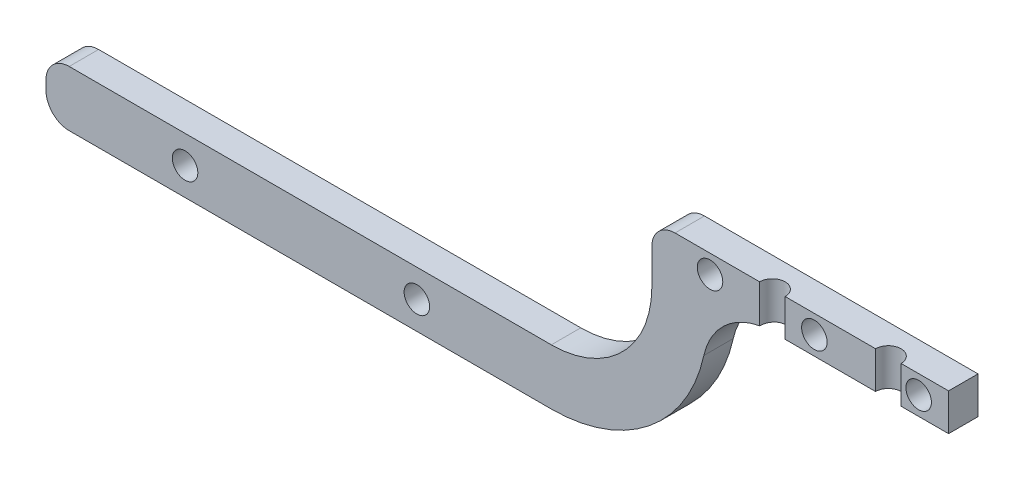
ISO-10303-21;
HEADER;
FILE_DESCRIPTION(('STEP AP214'),'2;1');
FILE_NAME('part.step','',(''),(''),'','','');
FILE_SCHEMA(('AUTOMOTIVE_DESIGN { 1 0 10303 214 1 1 1 1 }'));
ENDSEC;
DATA;
#1=APPLICATION_CONTEXT('core data for automotive mechanical design processes');
#2=APPLICATION_PROTOCOL_DEFINITION('international standard','automotive_design',2000,#1);
#3=PRODUCT_CONTEXT('',#1,'mechanical');
#4=PRODUCT('Part','Part','',(#3));
#5=PRODUCT_RELATED_PRODUCT_CATEGORY('part','',(#4));
#6=PRODUCT_DEFINITION_FORMATION('','',#4);
#7=PRODUCT_DEFINITION_CONTEXT('part definition',#1,'design');
#8=PRODUCT_DEFINITION('design','',#6,#7);
#9=PRODUCT_DEFINITION_SHAPE('','',#8);
#10=(LENGTH_UNIT() NAMED_UNIT(*) SI_UNIT(.MILLI.,.METRE.));
#11=(NAMED_UNIT(*) PLANE_ANGLE_UNIT() SI_UNIT($,.RADIAN.));
#12=(NAMED_UNIT(*) SI_UNIT($,.STERADIAN.) SOLID_ANGLE_UNIT());
#13=UNCERTAINTY_MEASURE_WITH_UNIT(LENGTH_MEASURE(1.E-05),#10,'distance_accuracy_value','');
#14=(GEOMETRIC_REPRESENTATION_CONTEXT(3) GLOBAL_UNCERTAINTY_ASSIGNED_CONTEXT((#13)) GLOBAL_UNIT_ASSIGNED_CONTEXT((#10,
#11,#12)) REPRESENTATION_CONTEXT('',''));
#15=CARTESIAN_POINT('',(0.,0.,0.));
#16=DIRECTION('',(0.,0.,1.));
#17=DIRECTION('',(1.,0.,0.));
#18=AXIS2_PLACEMENT_3D('',#15,#16,#17);
#19=CARTESIAN_POINT('',(-85.6878302558046,-12.5521697441954,6.35));
#20=DIRECTION('',(0.,0.,1.));
#21=DIRECTION('',(1.,0.,0.));
#22=AXIS2_PLACEMENT_3D('',#19,#20,#21);
#23=PLANE('',#22);
#24=DIRECTION('',(0.,1.,0.));
#25=VECTOR('',#24,1.);
#26=CARTESIAN_POINT('',(-10.25,-46.241,6.35));
#27=LINE('',#26,#25);
#28=CARTESIAN_POINT('',(-10.25,0.,6.35));
#29=VERTEX_POINT('',#28);
#30=CARTESIAN_POINT('',(-10.25,-8.,6.35));
#31=VERTEX_POINT('',#30);
#32=EDGE_CURVE('E166',#29,#31,#27,.F.);
#33=ORIENTED_EDGE('',*,*,#32,.T.);
#34=DIRECTION('',(1.,0.,0.));
#35=VECTOR('',#34,1.);
#36=CARTESIAN_POINT('',(0.,-8.,6.35));
#37=LINE('',#36,#35);
#38=CARTESIAN_POINT('',(0.,-8.,6.35));
#39=VERTEX_POINT('',#38);
#40=EDGE_CURVE('E175',#31,#39,#37,.T.);
#41=ORIENTED_EDGE('',*,*,#40,.T.);
#42=DIRECTION('',(0.,1.,0.));
#43=VECTOR('',#42,1.);
#44=CARTESIAN_POINT('',(0.,0.,6.35));
#45=LINE('',#44,#43);
#46=CARTESIAN_POINT('',(0.,0.,6.35));
#47=VERTEX_POINT('',#46);
#48=EDGE_CURVE('E213',#39,#47,#45,.T.);
#49=ORIENTED_EDGE('',*,*,#48,.T.);
#50=DIRECTION('',(-1.,0.,0.));
#51=VECTOR('',#50,1.);
#52=CARTESIAN_POINT('',(0.,0.,6.35));
#53=LINE('',#52,#51);
#54=EDGE_CURVE('E338',#47,#29,#53,.T.);
#55=ORIENTED_EDGE('',*,*,#54,.T.);
#56=EDGE_LOOP('',(#33,#41,#49,#55));
#57=FACE_BOUND('',#56,.T.);
#58=CARTESIAN_POINT('',(-6.45253062163277,-4.,6.35));
#59=DIRECTION('',(0.,0.,1.));
#60=DIRECTION('',(1.,0.,0.));
#61=AXIS2_PLACEMENT_3D('',#58,#59,#60);
#62=CIRCLE('',#61,2.75);
#63=CARTESIAN_POINT('',(-3.70253062163277,-4.,6.35));
#64=VERTEX_POINT('',#63);
#65=EDGE_CURVE('E326',#64,#64,#62,.T.);
#66=ORIENTED_EDGE('',*,*,#65,.F.);
#67=EDGE_LOOP('',(#66));
#68=FACE_BOUND('',#67,.T.);
#69=ADVANCED_FACE('F39',(#57,#68),#23,.T.);
#70=DIRECTION('',(0.,1.,0.));
#71=VECTOR('',#70,1.);
#72=CARTESIAN_POINT('',(-15.75,-46.241,6.35));
#73=LINE('',#72,#71);
#74=CARTESIAN_POINT('',(-15.75,-8.,6.35));
#75=VERTEX_POINT('',#74);
#76=CARTESIAN_POINT('',(-15.75,0.,6.35));
#77=VERTEX_POINT('',#76);
#78=EDGE_CURVE('E157',#75,#77,#73,.T.);
#79=ORIENTED_EDGE('',*,*,#78,.T.);
#80=CARTESIAN_POINT('',(-35.25,0.,6.35));
#81=VERTEX_POINT('',#80);
#82=EDGE_CURVE('E342',#77,#81,#53,.T.);
#83=ORIENTED_EDGE('',*,*,#82,.T.);
#84=DIRECTION('',(0.,1.,0.));
#85=VECTOR('',#84,1.);
#86=CARTESIAN_POINT('',(-35.25,-46.241,6.35));
#87=LINE('',#86,#85);
#88=CARTESIAN_POINT('',(-35.25,-8.00000000000001,6.35));
#89=VERTEX_POINT('',#88);
#90=EDGE_CURVE('E181',#81,#89,#87,.F.);
#91=ORIENTED_EDGE('',*,*,#90,.T.);
#92=EDGE_CURVE('E173',#89,#75,#37,.T.);
#93=ORIENTED_EDGE('',*,*,#92,.T.);
#94=EDGE_LOOP('',(#79,#83,#91,#93));
#95=FACE_BOUND('',#94,.T.);
#96=CARTESIAN_POINT('',(-28.9525306216328,-4.00000000000001,6.35));
#97=DIRECTION('',(0.,0.,1.));
#98=DIRECTION('',(1.,0.,0.));
#99=AXIS2_PLACEMENT_3D('',#96,#97,#98);
#100=CIRCLE('',#99,2.75);
#101=CARTESIAN_POINT('',(-26.2025306216328,-4.00000000000001,6.35));
#102=VERTEX_POINT('',#101);
#103=EDGE_CURVE('E330',#102,#102,#100,.T.);
#104=ORIENTED_EDGE('',*,*,#103,.F.);
#105=EDGE_LOOP('',(#104));
#106=FACE_BOUND('',#105,.T.);
#107=ADVANCED_FACE('F179',(#95,#106),#23,.T.);
#108=CARTESIAN_POINT('',(0.,0.,6.35));
#109=DIRECTION('',(-1.,0.,0.));
#110=DIRECTION('',(0.,-1.,0.));
#111=AXIS2_PLACEMENT_3D('',#108,#109,#110);
#112=PLANE('',#111);
#113=DIRECTION('',(0.,1.,0.));
#114=VECTOR('',#113,1.);
#115=CARTESIAN_POINT('',(0.,0.,0.));
#116=LINE('',#115,#114);
#117=CARTESIAN_POINT('',(0.,-8.,0.));
#118=VERTEX_POINT('',#117);
#119=CARTESIAN_POINT('',(0.,0.,0.));
#120=VERTEX_POINT('',#119);
#121=EDGE_CURVE('E191',#118,#120,#116,.T.);
#122=ORIENTED_EDGE('',*,*,#121,.T.);
#123=DIRECTION('',(0.,0.,-1.));
#124=VECTOR('',#123,1.);
#125=CARTESIAN_POINT('',(0.,0.,6.35));
#126=LINE('',#125,#124);
#127=EDGE_CURVE('E223',#47,#120,#126,.T.);
#128=ORIENTED_EDGE('',*,*,#127,.F.);
#129=ORIENTED_EDGE('',*,*,#48,.F.);
#130=DIRECTION('',(0.,0.,-1.));
#131=VECTOR('',#130,1.);
#132=CARTESIAN_POINT('',(0.,-8.,6.35));
#133=LINE('',#132,#131);
#134=EDGE_CURVE('E182',#39,#118,#133,.T.);
#135=ORIENTED_EDGE('',*,*,#134,.T.);
#136=EDGE_LOOP('',(#122,#128,#129,#135));
#137=FACE_BOUND('',#136,.T.);
#138=ADVANCED_FACE('F301',(#137),#112,.F.);
#139=CARTESIAN_POINT('',(0.,0.,6.35));
#140=DIRECTION('',(0.,-1.,0.));
#141=DIRECTION('',(1.,0.,0.));
#142=AXIS2_PLACEMENT_3D('',#139,#140,#141);
#143=PLANE('',#142);
#144=ORIENTED_EDGE('',*,*,#82,.F.);
#145=CARTESIAN_POINT('',(-13.,0.,6.35));
#146=DIRECTION('',(0.,1.,0.));
#147=DIRECTION('',(-1.,0.,0.));
#148=AXIS2_PLACEMENT_3D('',#145,#146,#147);
#149=CIRCLE('',#148,2.75);
#150=EDGE_CURVE('E56',#29,#77,#149,.T.);
#151=ORIENTED_EDGE('',*,*,#150,.F.);
#152=ORIENTED_EDGE('',*,*,#54,.F.);
#153=ORIENTED_EDGE('',*,*,#127,.T.);
#154=DIRECTION('',(-1.,0.,0.));
#155=VECTOR('',#154,1.);
#156=CARTESIAN_POINT('',(0.,0.,0.));
#157=LINE('',#156,#155);
#158=CARTESIAN_POINT('',(-59.,0.,0.));
#159=VERTEX_POINT('',#158);
#160=EDGE_CURVE('E194',#120,#159,#157,.T.);
#161=ORIENTED_EDGE('',*,*,#160,.T.);
#162=DIRECTION('',(0.,0.,-1.));
#163=VECTOR('',#162,1.);
#164=CARTESIAN_POINT('',(-59.,0.,6.35));
#165=LINE('',#164,#163);
#166=CARTESIAN_POINT('',(-59.,0.,6.35));
#167=VERTEX_POINT('',#166);
#168=EDGE_CURVE('E235',#159,#167,#165,.F.);
#169=ORIENTED_EDGE('',*,*,#168,.T.);
#170=CARTESIAN_POINT('',(-40.75,0.,6.35));
#171=VERTEX_POINT('',#170);
#172=EDGE_CURVE('E337',#171,#167,#53,.T.);
#173=ORIENTED_EDGE('',*,*,#172,.F.);
#174=CARTESIAN_POINT('',(-38.,0.,6.35));
#175=DIRECTION('',(0.,1.,0.));
#176=DIRECTION('',(-1.,0.,0.));
#177=AXIS2_PLACEMENT_3D('',#174,#175,#176);
#178=CIRCLE('',#177,2.75);
#179=EDGE_CURVE('E363',#81,#171,#178,.T.);
#180=ORIENTED_EDGE('',*,*,#179,.F.);
#181=EDGE_LOOP('',(#144,#151,#152,#153,#161,#169,#173,#180));
#182=FACE_BOUND('',#181,.T.);
#183=ADVANCED_FACE('F449',(#182),#143,.F.);
#184=CARTESIAN_POINT('',(-64.,0.,6.35));
#185=DIRECTION('',(1.,0.,0.));
#186=DIRECTION('',(0.,0.,-1.));
#187=AXIS2_PLACEMENT_3D('',#184,#185,#186);
#188=PLANE('',#187);
#189=DIRECTION('',(0.,-1.,0.));
#190=VECTOR('',#189,1.);
#191=CARTESIAN_POINT('',(-64.,0.,6.35));
#192=LINE('',#191,#190);
#193=CARTESIAN_POINT('',(-64.,-5.00000000000001,6.35));
#194=VERTEX_POINT('',#193);
#195=CARTESIAN_POINT('',(-64.,-12.5521697441954,6.35));
#196=VERTEX_POINT('',#195);
#197=EDGE_CURVE('E341',#194,#196,#192,.T.);
#198=ORIENTED_EDGE('',*,*,#197,.F.);
#199=DIRECTION('',(0.,0.,-1.));
#200=VECTOR('',#199,1.);
#201=CARTESIAN_POINT('',(-64.,-5.00000000000001,6.35));
#202=LINE('',#201,#200);
#203=CARTESIAN_POINT('',(-64.,-5.00000000000001,0.));
#204=VERTEX_POINT('',#203);
#205=EDGE_CURVE('E226',#194,#204,#202,.T.);
#206=ORIENTED_EDGE('',*,*,#205,.T.);
#207=DIRECTION('',(0.,-1.,0.));
#208=VECTOR('',#207,1.);
#209=CARTESIAN_POINT('',(-64.,0.,0.));
#210=LINE('',#209,#208);
#211=CARTESIAN_POINT('',(-64.,-12.5521697441954,0.));
#212=VERTEX_POINT('',#211);
#213=EDGE_CURVE('E197',#204,#212,#210,.T.);
#214=ORIENTED_EDGE('',*,*,#213,.T.);
#215=DIRECTION('',(0.,0.,-1.));
#216=VECTOR('',#215,1.);
#217=CARTESIAN_POINT('',(-64.,-12.5521697441954,6.35));
#218=LINE('',#217,#216);
#219=EDGE_CURVE('E220',#196,#212,#218,.T.);
#220=ORIENTED_EDGE('',*,*,#219,.F.);
#221=EDGE_LOOP('',(#198,#206,#214,#220));
#222=FACE_BOUND('',#221,.T.);
#223=ADVANCED_FACE('F452',(#222),#188,.F.);
#224=CARTESIAN_POINT('',(-85.6878302558046,-12.5521697441954,6.35));
#225=DIRECTION('',(0.,0.,-1.));
#226=DIRECTION('',(-1.,0.,0.));
#227=AXIS2_PLACEMENT_3D('',#224,#225,#226);
#228=CYLINDRICAL_SURFACE('',#227,21.6878302558046);
#229=CARTESIAN_POINT('',(-85.6878302558046,-12.5521697441954,0.));
#230=DIRECTION('',(0.,0.,-1.));
#231=DIRECTION('',(-1.,0.,0.));
#232=AXIS2_PLACEMENT_3D('',#229,#230,#231);
#233=CIRCLE('',#232,21.6878302558046);
#234=CARTESIAN_POINT('',(-85.6878302558046,-34.24,0.));
#235=VERTEX_POINT('',#234);
#236=EDGE_CURVE('E199',#212,#235,#233,.T.);
#237=ORIENTED_EDGE('',*,*,#236,.T.);
#238=DIRECTION('',(0.,0.,-1.));
#239=VECTOR('',#238,1.);
#240=CARTESIAN_POINT('',(-85.6878302558046,-34.24,6.35));
#241=LINE('',#240,#239);
#242=CARTESIAN_POINT('',(-85.6878302558046,-34.24,6.35));
#243=VERTEX_POINT('',#242);
#244=EDGE_CURVE('E217',#243,#235,#241,.T.);
#245=ORIENTED_EDGE('',*,*,#244,.F.);
#246=CARTESIAN_POINT('',(-85.6878302558046,-12.5521697441954,6.35));
#247=DIRECTION('',(0.,0.,-1.));
#248=DIRECTION('',(-1.,0.,0.));
#249=AXIS2_PLACEMENT_3D('',#246,#247,#248);
#250=CIRCLE('',#249,21.6878302558046);
#251=EDGE_CURVE('E344',#196,#243,#250,.T.);
#252=ORIENTED_EDGE('',*,*,#251,.F.);
#253=ORIENTED_EDGE('',*,*,#219,.T.);
#254=EDGE_LOOP('',(#237,#245,#252,#253));
#255=FACE_BOUND('',#254,.T.);
#256=ADVANCED_FACE('F516',(#255),#228,.F.);
#257=CARTESIAN_POINT('',(-85.6878302558046,-34.24,6.35));
#258=DIRECTION('',(0.,-1.,0.));
#259=DIRECTION('',(1.,0.,0.));
#260=AXIS2_PLACEMENT_3D('',#257,#258,#259);
#261=PLANE('',#260);
#262=DIRECTION('',(-1.,0.,0.));
#263=VECTOR('',#262,1.);
#264=CARTESIAN_POINT('',(-85.6878302558046,-34.24,0.));
#265=LINE('',#264,#263);
#266=CARTESIAN_POINT('',(-189.687830255805,-34.24,0.));
#267=VERTEX_POINT('',#266);
#268=EDGE_CURVE('E201',#235,#267,#265,.T.);
#269=ORIENTED_EDGE('',*,*,#268,.T.);
#270=DIRECTION('',(0.,0.,-1.));
#271=VECTOR('',#270,1.);
#272=CARTESIAN_POINT('',(-189.687830255805,-34.24,6.35));
#273=LINE('',#272,#271);
#274=CARTESIAN_POINT('',(-189.687830255805,-34.24,6.35));
#275=VERTEX_POINT('',#274);
#276=EDGE_CURVE('E252',#267,#275,#273,.F.);
#277=ORIENTED_EDGE('',*,*,#276,.T.);
#278=DIRECTION('',(-1.,0.,0.));
#279=VECTOR('',#278,1.);
#280=CARTESIAN_POINT('',(-85.6878302558046,-34.24,6.35));
#281=LINE('',#280,#279);
#282=EDGE_CURVE('E346',#243,#275,#281,.T.);
#283=ORIENTED_EDGE('',*,*,#282,.F.);
#284=ORIENTED_EDGE('',*,*,#244,.T.);
#285=EDGE_LOOP('',(#269,#277,#283,#284));
#286=FACE_BOUND('',#285,.T.);
#287=ADVANCED_FACE('F512',(#286),#261,.F.);
#288=CARTESIAN_POINT('',(-194.687830255805,-34.24,6.35));
#289=DIRECTION('',(1.,0.,0.));
#290=DIRECTION('',(0.,0.,-1.));
#291=AXIS2_PLACEMENT_3D('',#288,#289,#290);
#292=PLANE('',#291);
#293=DIRECTION('',(0.,-1.,0.));
#294=VECTOR('',#293,1.);
#295=CARTESIAN_POINT('',(-194.687830255805,-34.24,0.));
#296=LINE('',#295,#294);
#297=CARTESIAN_POINT('',(-194.687830255805,-39.24,0.));
#298=VERTEX_POINT('',#297);
#299=CARTESIAN_POINT('',(-194.687830255805,-41.24,0.));
#300=VERTEX_POINT('',#299);
#301=EDGE_CURVE('E204',#298,#300,#296,.T.);
#302=ORIENTED_EDGE('',*,*,#301,.T.);
#303=DIRECTION('',(0.,0.,-1.));
#304=VECTOR('',#303,1.);
#305=CARTESIAN_POINT('',(-194.687830255805,-41.24,6.35));
#306=LINE('',#305,#304);
#307=CARTESIAN_POINT('',(-194.687830255805,-41.24,6.35));
#308=VERTEX_POINT('',#307);
#309=EDGE_CURVE('E250',#300,#308,#306,.F.);
#310=ORIENTED_EDGE('',*,*,#309,.T.);
#311=DIRECTION('',(0.,-1.,0.));
#312=VECTOR('',#311,1.);
#313=CARTESIAN_POINT('',(-194.687830255805,-34.24,6.35));
#314=LINE('',#313,#312);
#315=CARTESIAN_POINT('',(-194.687830255805,-39.24,6.35));
#316=VERTEX_POINT('',#315);
#317=EDGE_CURVE('E349',#316,#308,#314,.T.);
#318=ORIENTED_EDGE('',*,*,#317,.F.);
#319=DIRECTION('',(0.,0.,-1.));
#320=VECTOR('',#319,1.);
#321=CARTESIAN_POINT('',(-194.687830255805,-39.24,6.35));
#322=LINE('',#321,#320);
#323=EDGE_CURVE('E247',#316,#298,#322,.T.);
#324=ORIENTED_EDGE('',*,*,#323,.T.);
#325=EDGE_LOOP('',(#302,#310,#318,#324));
#326=FACE_BOUND('',#325,.T.);
#327=ADVANCED_FACE('F506',(#326),#292,.F.);
#328=CARTESIAN_POINT('',(-194.687830255805,-46.24,6.35));
#329=DIRECTION('',(0.,1.,0.));
#330=DIRECTION('',(-1.,0.,0.));
#331=AXIS2_PLACEMENT_3D('',#328,#329,#330);
#332=PLANE('',#331);
#333=DIRECTION('',(1.,0.,0.));
#334=VECTOR('',#333,1.);
#335=CARTESIAN_POINT('',(-194.687830255805,-46.24,6.35));
#336=LINE('',#335,#334);
#337=CARTESIAN_POINT('',(-189.687830255805,-46.24,6.35));
#338=VERTEX_POINT('',#337);
#339=CARTESIAN_POINT('',(-85.6878302558046,-46.24,6.35));
#340=VERTEX_POINT('',#339);
#341=EDGE_CURVE('E351',#338,#340,#336,.T.);
#342=ORIENTED_EDGE('',*,*,#341,.F.);
#343=DIRECTION('',(0.,0.,-1.));
#344=VECTOR('',#343,1.);
#345=CARTESIAN_POINT('',(-189.687830255805,-46.24,6.35));
#346=LINE('',#345,#344);
#347=CARTESIAN_POINT('',(-189.687830255805,-46.24,0.));
#348=VERTEX_POINT('',#347);
#349=EDGE_CURVE('E244',#338,#348,#346,.T.);
#350=ORIENTED_EDGE('',*,*,#349,.T.);
#351=DIRECTION('',(1.,0.,0.));
#352=VECTOR('',#351,1.);
#353=CARTESIAN_POINT('',(-194.687830255805,-46.24,0.));
#354=LINE('',#353,#352);
#355=CARTESIAN_POINT('',(-85.6878302558046,-46.24,0.));
#356=VERTEX_POINT('',#355);
#357=EDGE_CURVE('E207',#348,#356,#354,.T.);
#358=ORIENTED_EDGE('',*,*,#357,.T.);
#359=DIRECTION('',(0.,0.,-1.));
#360=VECTOR('',#359,1.);
#361=CARTESIAN_POINT('',(-85.6878302558046,-46.24,6.35));
#362=LINE('',#361,#360);
#363=EDGE_CURVE('E185',#340,#356,#362,.T.);
#364=ORIENTED_EDGE('',*,*,#363,.F.);
#365=EDGE_LOOP('',(#342,#350,#358,#364));
#366=FACE_BOUND('',#365,.T.);
#367=ADVANCED_FACE('F504',(#366),#332,.F.);
#368=CARTESIAN_POINT('',(-85.6878302558046,-12.5521697441954,6.35));
#369=DIRECTION('',(0.,0.,-1.));
#370=DIRECTION('',(-1.,0.,0.));
#371=AXIS2_PLACEMENT_3D('',#368,#369,#370);
#372=CYLINDRICAL_SURFACE('',#371,33.6878302558046);
#373=CARTESIAN_POINT('',(-85.6878302558046,-12.5521697441954,0.));
#374=DIRECTION('',(0.,0.,1.));
#375=DIRECTION('',(1.,0.,0.));
#376=AXIS2_PLACEMENT_3D('',#373,#374,#375);
#377=CIRCLE('',#376,33.6878302558046);
#378=CARTESIAN_POINT('',(-52.7847704375923,-19.7811781093206,0.));
#379=VERTEX_POINT('',#378);
#380=EDGE_CURVE('E209',#356,#379,#377,.T.);
#381=ORIENTED_EDGE('',*,*,#380,.T.);
#382=DIRECTION('',(0.,0.,-1.));
#383=VECTOR('',#382,1.);
#384=CARTESIAN_POINT('',(-52.7847704375923,-19.7811781093206,6.35));
#385=LINE('',#384,#383);
#386=CARTESIAN_POINT('',(-52.7847704375923,-19.7811781093206,6.35));
#387=VERTEX_POINT('',#386);
#388=EDGE_CURVE('E256',#379,#387,#385,.F.);
#389=ORIENTED_EDGE('',*,*,#388,.T.);
#390=CARTESIAN_POINT('',(-85.6878302558046,-12.5521697441954,6.35));
#391=DIRECTION('',(0.,0.,1.));
#392=DIRECTION('',(1.,0.,0.));
#393=AXIS2_PLACEMENT_3D('',#390,#391,#392);
#394=CIRCLE('',#393,33.6878302558046);
#395=EDGE_CURVE('E187',#340,#387,#394,.T.);
#396=ORIENTED_EDGE('',*,*,#395,.F.);
#397=ORIENTED_EDGE('',*,*,#363,.T.);
#398=EDGE_LOOP('',(#381,#389,#396,#397));
#399=FACE_BOUND('',#398,.T.);
#400=ADVANCED_FACE('F313',(#399),#372,.T.);
#401=CARTESIAN_POINT('',(0.,-8.,6.35));
#402=DIRECTION('',(0.,1.,0.));
#403=DIRECTION('',(-1.,0.,0.));
#404=AXIS2_PLACEMENT_3D('',#401,#402,#403);
#405=PLANE('',#404);
#406=ORIENTED_EDGE('',*,*,#40,.F.);
#407=CARTESIAN_POINT('',(-13.,-8.,6.35));
#408=DIRECTION('',(0.,1.,0.));
#409=DIRECTION('',(-1.,0.,0.));
#410=AXIS2_PLACEMENT_3D('',#407,#408,#409);
#411=CIRCLE('',#410,2.75);
#412=EDGE_CURVE('E160',#75,#31,#411,.F.);
#413=ORIENTED_EDGE('',*,*,#412,.F.);
#414=ORIENTED_EDGE('',*,*,#92,.F.);
#415=CARTESIAN_POINT('',(-38.,-8.00000000000001,6.35));
#416=DIRECTION('',(0.,1.,0.));
#417=DIRECTION('',(-1.,0.,0.));
#418=AXIS2_PLACEMENT_3D('',#415,#416,#417);
#419=CIRCLE('',#418,2.75);
#420=CARTESIAN_POINT('',(-38.134200973026,-8.00000000000001,3.60327647935966));
#421=VERTEX_POINT('',#420);
#422=EDGE_CURVE('E364',#421,#89,#419,.F.);
#423=ORIENTED_EDGE('',*,*,#422,.F.);
#424=DIRECTION('',(0.,0.,1.));
#425=VECTOR('',#424,1.);
#426=CARTESIAN_POINT('',(-38.134200973026,-8.00000000000001,0.));
#427=LINE('',#426,#425);
#428=CARTESIAN_POINT('',(-38.134200973026,-8.00000000000001,0.));
#429=VERTEX_POINT('',#428);
#430=EDGE_CURVE('E254',#421,#429,#427,.F.);
#431=ORIENTED_EDGE('',*,*,#430,.T.);
#432=DIRECTION('',(1.,0.,0.));
#433=VECTOR('',#432,1.);
#434=CARTESIAN_POINT('',(0.,-8.,0.));
#435=LINE('',#434,#433);
#436=EDGE_CURVE('E212',#429,#118,#435,.T.);
#437=ORIENTED_EDGE('',*,*,#436,.T.);
#438=ORIENTED_EDGE('',*,*,#134,.F.);
#439=EDGE_LOOP('',(#406,#413,#414,#423,#431,#437,#438));
#440=FACE_BOUND('',#439,.T.);
#441=ADVANCED_FACE('F171',(#440),#405,.F.);
#442=DIRECTION('',(0.,1.,0.));
#443=VECTOR('',#442,1.);
#444=CARTESIAN_POINT('',(-40.75,-46.241,6.35));
#445=LINE('',#444,#443);
#446=CARTESIAN_POINT('',(-40.75,-8.22984104857088,6.35));
#447=VERTEX_POINT('',#446);
#448=EDGE_CURVE('E64',#447,#171,#445,.T.);
#449=ORIENTED_EDGE('',*,*,#448,.T.);
#450=ORIENTED_EDGE('',*,*,#172,.T.);
#451=CARTESIAN_POINT('',(-59.,-5.00000000000001,6.35));
#452=DIRECTION('',(0.,0.,1.));
#453=DIRECTION('',(1.,0.,0.));
#454=AXIS2_PLACEMENT_3D('',#451,#452,#453);
#455=CIRCLE('',#454,5.);
#456=EDGE_CURVE('E242',#167,#194,#455,.T.);
#457=ORIENTED_EDGE('',*,*,#456,.T.);
#458=ORIENTED_EDGE('',*,*,#197,.T.);
#459=ORIENTED_EDGE('',*,*,#251,.T.);
#460=ORIENTED_EDGE('',*,*,#282,.T.);
#461=CARTESIAN_POINT('',(-189.687830255805,-39.24,6.35));
#462=DIRECTION('',(0.,0.,1.));
#463=DIRECTION('',(1.,0.,0.));
#464=AXIS2_PLACEMENT_3D('',#461,#462,#463);
#465=CIRCLE('',#464,5.);
#466=EDGE_CURVE('E238',#275,#316,#465,.T.);
#467=ORIENTED_EDGE('',*,*,#466,.T.);
#468=ORIENTED_EDGE('',*,*,#317,.T.);
#469=CARTESIAN_POINT('',(-189.687830255805,-41.24,6.35));
#470=DIRECTION('',(0.,0.,1.));
#471=DIRECTION('',(1.,0.,0.));
#472=AXIS2_PLACEMENT_3D('',#469,#470,#471);
#473=CIRCLE('',#472,5.);
#474=EDGE_CURVE('E240',#308,#338,#473,.T.);
#475=ORIENTED_EDGE('',*,*,#474,.T.);
#476=ORIENTED_EDGE('',*,*,#341,.T.);
#477=ORIENTED_EDGE('',*,*,#395,.T.);
#478=CARTESIAN_POINT('',(-38.134200973026,-23.,6.35));
#479=DIRECTION('',(0.,0.,1.));
#480=DIRECTION('',(1.,0.,0.));
#481=AXIS2_PLACEMENT_3D('',#478,#479,#480);
#482=CIRCLE('',#481,15.);
#483=EDGE_CURVE('E11',#387,#447,#482,.F.);
#484=ORIENTED_EDGE('',*,*,#483,.T.);
#485=EDGE_LOOP('',(#449,#450,#457,#458,#459,#460,#467,#468,#475,#476,#477,#484));
#486=FACE_BOUND('',#485,.T.);
#487=CARTESIAN_POINT('',(-164.687830255805,-40.24,6.35));
#488=DIRECTION('',(0.,0.,1.));
#489=DIRECTION('',(1.,0.,0.));
#490=AXIS2_PLACEMENT_3D('',#487,#488,#489);
#491=CIRCLE('',#490,2.75000000000001);
#492=CARTESIAN_POINT('',(-161.937830255805,-40.24,6.35));
#493=VERTEX_POINT('',#492);
#494=EDGE_CURVE('E263',#493,#493,#491,.T.);
#495=ORIENTED_EDGE('',*,*,#494,.F.);
#496=EDGE_LOOP('',(#495));
#497=FACE_BOUND('',#496,.T.);
#498=CARTESIAN_POINT('',(-51.4525306216328,-4.00000000000001,6.35));
#499=DIRECTION('',(0.,0.,1.));
#500=DIRECTION('',(1.,0.,0.));
#501=AXIS2_PLACEMENT_3D('',#498,#499,#500);
#502=CIRCLE('',#501,2.75);
#503=CARTESIAN_POINT('',(-48.7025306216328,-4.00000000000001,6.35));
#504=VERTEX_POINT('',#503);
#505=EDGE_CURVE('E176',#504,#504,#502,.T.);
#506=ORIENTED_EDGE('',*,*,#505,.F.);
#507=EDGE_LOOP('',(#506));
#508=FACE_BOUND('',#507,.T.);
#509=CARTESIAN_POINT('',(-114.687830255805,-40.24,6.35));
#510=DIRECTION('',(0.,0.,1.));
#511=DIRECTION('',(1.,0.,0.));
#512=AXIS2_PLACEMENT_3D('',#509,#510,#511);
#513=CIRCLE('',#512,2.75000000000001);
#514=CARTESIAN_POINT('',(-111.937830255805,-40.24,6.35));
#515=VERTEX_POINT('',#514);
#516=EDGE_CURVE('E324',#515,#515,#513,.T.);
#517=ORIENTED_EDGE('',*,*,#516,.F.);
#518=EDGE_LOOP('',(#517));
#519=FACE_BOUND('',#518,.T.);
#520=ADVANCED_FACE('F297',(#486,#497,#508,#519),#23,.T.);
#521=CARTESIAN_POINT('',(-85.6878302558046,-12.5521697441954,0.));
#522=DIRECTION('',(0.,0.,1.));
#523=DIRECTION('',(1.,0.,0.));
#524=AXIS2_PLACEMENT_3D('',#521,#522,#523);
#525=PLANE('',#524);
#526=CARTESIAN_POINT('',(-164.687830255805,-40.24,0.));
#527=DIRECTION('',(0.,0.,1.));
#528=DIRECTION('',(1.,0.,0.));
#529=AXIS2_PLACEMENT_3D('',#526,#527,#528);
#530=CIRCLE('',#529,2.75000000000001);
#531=CARTESIAN_POINT('',(-161.937830255805,-40.24,0.));
#532=VERTEX_POINT('',#531);
#533=EDGE_CURVE('E43',#532,#532,#530,.T.);
#534=ORIENTED_EDGE('',*,*,#533,.T.);
#535=EDGE_LOOP('',(#534));
#536=FACE_BOUND('',#535,.T.);
#537=CARTESIAN_POINT('',(-51.4525306216328,-4.00000000000001,0.));
#538=DIRECTION('',(0.,0.,1.));
#539=DIRECTION('',(1.,0.,0.));
#540=AXIS2_PLACEMENT_3D('',#537,#538,#539);
#541=CIRCLE('',#540,2.75);
#542=CARTESIAN_POINT('',(-48.7025306216328,-4.00000000000001,0.));
#543=VERTEX_POINT('',#542);
#544=EDGE_CURVE('E268',#543,#543,#541,.T.);
#545=ORIENTED_EDGE('',*,*,#544,.T.);
#546=EDGE_LOOP('',(#545));
#547=FACE_BOUND('',#546,.T.);
#548=CARTESIAN_POINT('',(-28.9525306216328,-4.00000000000001,0.));
#549=DIRECTION('',(0.,0.,1.));
#550=DIRECTION('',(1.,0.,0.));
#551=AXIS2_PLACEMENT_3D('',#548,#549,#550);
#552=CIRCLE('',#551,2.75);
#553=CARTESIAN_POINT('',(-26.2025306216328,-4.00000000000001,0.));
#554=VERTEX_POINT('',#553);
#555=EDGE_CURVE('E266',#554,#554,#552,.T.);
#556=ORIENTED_EDGE('',*,*,#555,.T.);
#557=EDGE_LOOP('',(#556));
#558=FACE_BOUND('',#557,.T.);
#559=CARTESIAN_POINT('',(-6.45253062163277,-4.,0.));
#560=DIRECTION('',(0.,0.,1.));
#561=DIRECTION('',(1.,0.,0.));
#562=AXIS2_PLACEMENT_3D('',#559,#560,#561);
#563=CIRCLE('',#562,2.75);
#564=CARTESIAN_POINT('',(-3.70253062163277,-4.,0.));
#565=VERTEX_POINT('',#564);
#566=EDGE_CURVE('E262',#565,#565,#563,.T.);
#567=ORIENTED_EDGE('',*,*,#566,.T.);
#568=EDGE_LOOP('',(#567));
#569=FACE_BOUND('',#568,.T.);
#570=CARTESIAN_POINT('',(-114.687830255805,-40.24,0.));
#571=DIRECTION('',(0.,0.,1.));
#572=DIRECTION('',(1.,0.,0.));
#573=AXIS2_PLACEMENT_3D('',#570,#571,#572);
#574=CIRCLE('',#573,2.75000000000001);
#575=CARTESIAN_POINT('',(-111.937830255805,-40.24,0.));
#576=VERTEX_POINT('',#575);
#577=EDGE_CURVE('E259',#576,#576,#574,.T.);
#578=ORIENTED_EDGE('',*,*,#577,.T.);
#579=EDGE_LOOP('',(#578));
#580=FACE_BOUND('',#579,.T.);
#581=ORIENTED_EDGE('',*,*,#213,.F.);
#582=CARTESIAN_POINT('',(-59.,-5.00000000000001,0.));
#583=DIRECTION('',(0.,0.,1.));
#584=DIRECTION('',(1.,0.,0.));
#585=AXIS2_PLACEMENT_3D('',#582,#583,#584);
#586=CIRCLE('',#585,5.);
#587=EDGE_CURVE('E233',#204,#159,#586,.F.);
#588=ORIENTED_EDGE('',*,*,#587,.T.);
#589=ORIENTED_EDGE('',*,*,#160,.F.);
#590=ORIENTED_EDGE('',*,*,#121,.F.);
#591=ORIENTED_EDGE('',*,*,#436,.F.);
#592=CARTESIAN_POINT('',(-38.134200973026,-23.,0.));
#593=DIRECTION('',(0.,0.,1.));
#594=DIRECTION('',(1.,0.,0.));
#595=AXIS2_PLACEMENT_3D('',#592,#593,#594);
#596=CIRCLE('',#595,15.);
#597=EDGE_CURVE('E48',#429,#379,#596,.T.);
#598=ORIENTED_EDGE('',*,*,#597,.T.);
#599=ORIENTED_EDGE('',*,*,#380,.F.);
#600=ORIENTED_EDGE('',*,*,#357,.F.);
#601=CARTESIAN_POINT('',(-189.687830255805,-41.24,0.));
#602=DIRECTION('',(0.,0.,1.));
#603=DIRECTION('',(1.,0.,0.));
#604=AXIS2_PLACEMENT_3D('',#601,#602,#603);
#605=CIRCLE('',#604,5.);
#606=EDGE_CURVE('E231',#348,#300,#605,.F.);
#607=ORIENTED_EDGE('',*,*,#606,.T.);
#608=ORIENTED_EDGE('',*,*,#301,.F.);
#609=CARTESIAN_POINT('',(-189.687830255805,-39.24,0.));
#610=DIRECTION('',(0.,0.,1.));
#611=DIRECTION('',(1.,0.,0.));
#612=AXIS2_PLACEMENT_3D('',#609,#610,#611);
#613=CIRCLE('',#612,5.);
#614=EDGE_CURVE('E229',#298,#267,#613,.F.);
#615=ORIENTED_EDGE('',*,*,#614,.T.);
#616=ORIENTED_EDGE('',*,*,#268,.F.);
#617=ORIENTED_EDGE('',*,*,#236,.F.);
#618=EDGE_LOOP('',(#581,#588,#589,#590,#591,#598,#599,#600,#607,#608,#615,#616,#617));
#619=FACE_BOUND('',#618,.T.);
#620=ADVANCED_FACE('F275',(#536,#547,#558,#569,#580,#619),#525,.F.);
#621=CARTESIAN_POINT('',(-59.,-5.00000000000001,6.35));
#622=DIRECTION('',(0.,0.,-1.));
#623=DIRECTION('',(-1.,0.,0.));
#624=AXIS2_PLACEMENT_3D('',#621,#622,#623);
#625=CYLINDRICAL_SURFACE('',#624,5.);
#626=ORIENTED_EDGE('',*,*,#456,.F.);
#627=ORIENTED_EDGE('',*,*,#168,.F.);
#628=ORIENTED_EDGE('',*,*,#587,.F.);
#629=ORIENTED_EDGE('',*,*,#205,.F.);
#630=EDGE_LOOP('',(#626,#627,#628,#629));
#631=FACE_BOUND('',#630,.T.);
#632=ADVANCED_FACE('F312',(#631),#625,.T.);
#633=CARTESIAN_POINT('',(-189.687830255805,-41.24,6.35));
#634=DIRECTION('',(0.,0.,-1.));
#635=DIRECTION('',(-1.,0.,0.));
#636=AXIS2_PLACEMENT_3D('',#633,#634,#635);
#637=CYLINDRICAL_SURFACE('',#636,5.);
#638=ORIENTED_EDGE('',*,*,#474,.F.);
#639=ORIENTED_EDGE('',*,*,#309,.F.);
#640=ORIENTED_EDGE('',*,*,#606,.F.);
#641=ORIENTED_EDGE('',*,*,#349,.F.);
#642=EDGE_LOOP('',(#638,#639,#640,#641));
#643=FACE_BOUND('',#642,.T.);
#644=ADVANCED_FACE('F487',(#643),#637,.T.);
#645=CARTESIAN_POINT('',(-189.687830255805,-39.24,6.35));
#646=DIRECTION('',(0.,0.,-1.));
#647=DIRECTION('',(-1.,0.,0.));
#648=AXIS2_PLACEMENT_3D('',#645,#646,#647);
#649=CYLINDRICAL_SURFACE('',#648,5.);
#650=ORIENTED_EDGE('',*,*,#466,.F.);
#651=ORIENTED_EDGE('',*,*,#276,.F.);
#652=ORIENTED_EDGE('',*,*,#614,.F.);
#653=ORIENTED_EDGE('',*,*,#323,.F.);
#654=EDGE_LOOP('',(#650,#651,#652,#653));
#655=FACE_BOUND('',#654,.T.);
#656=ADVANCED_FACE('F390',(#655),#649,.T.);
#657=CARTESIAN_POINT('',(-38.134200973026,-23.,6.35));
#658=DIRECTION('',(0.,0.,-1.));
#659=DIRECTION('',(-1.,0.,0.));
#660=AXIS2_PLACEMENT_3D('',#657,#658,#659);
#661=CYLINDRICAL_SURFACE('',#660,15.);
#662=ORIENTED_EDGE('',*,*,#430,.F.);
#663=CARTESIAN_POINT('',(-40.75,-8.22984104857088,6.35));
#664=CARTESIAN_POINT('',(-40.7500080972724,-8.22984699101347,6.27326875695302));
#665=CARTESIAN_POINT('',(-40.7467886157137,-8.2292724269605,6.19654186146989));
#666=CARTESIAN_POINT('',(-40.7339572776425,-8.22700623356219,6.04364898798642));
#667=CARTESIAN_POINT('',(-40.7243461018775,-8.22531472317736,5.96748295112517));
#668=CARTESIAN_POINT('',(-40.6988115815261,-8.22086161029654,5.81635071512136));
#669=CARTESIAN_POINT('',(-40.6828968754241,-8.2181014723852,5.74138301941591));
#670=CARTESIAN_POINT('',(-40.6448933085259,-8.21159939722383,5.59309445941772));
#671=CARTESIAN_POINT('',(-40.6228044455548,-8.20785745962794,5.51977359570512));
#672=CARTESIAN_POINT('',(-40.5474853951663,-8.19531531042701,5.30302200597967));
#673=CARTESIAN_POINT('',(-40.4851850663686,-8.18519547214004,5.1626983850997));
#674=CARTESIAN_POINT('',(-40.3382913490116,-8.16263265839246,4.89456150797541));
#675=CARTESIAN_POINT('',(-40.2536972425044,-8.15018960811898,4.76674865480919));
#676=CARTESIAN_POINT('',(-40.0636291561988,-8.12429591017679,4.52580440938922));
#677=CARTESIAN_POINT('',(-39.9579635241052,-8.11083677620113,4.41282485056294));
#678=CARTESIAN_POINT('',(-39.7291330469812,-8.08459097296217,4.2060822960489));
#679=CARTESIAN_POINT('',(-39.6059632285734,-8.0718044962372,4.11232478038119));
#680=CARTESIAN_POINT('',(-39.3447066747785,-8.04834545162407,3.94617242937732));
#681=CARTESIAN_POINT('',(-39.2065318196386,-8.037686544222,3.873914268561));
#682=CARTESIAN_POINT('',(-38.9198350542954,-8.01990262153357,3.75375253861112));
#683=CARTESIAN_POINT('',(-38.7713241088749,-8.01277392456702,3.70582359506124));
#684=CARTESIAN_POINT('',(-38.5401150527382,-8.00527928528152,3.65231443372831));
#685=CARTESIAN_POINT('',(-38.4595154416064,-8.00330945581263,3.63742643401227));
#686=CARTESIAN_POINT('',(-38.2974163642852,-8.0006684992409,3.6149085369458));
#687=CARTESIAN_POINT('',(-38.2159185026345,-7.99999534577355,3.60726732427163));
#688=CARTESIAN_POINT('',(-38.134200973026,-8.00000000000001,3.60327647935966));
#689=B_SPLINE_CURVE_WITH_KNOTS('',3,(#663,#664,#665,#666,#667,#668,#669,#670,#671,#672,#673,
#674,#675,#676,#677,#678,#679,#680,#681,#682,#683,#684,#685,#686,#687,#688),.UNSPECIFIED.,.F.,
.F.,(4,2,2,2,2,2,2,2,2,2,2,2,4),(0.,0.230116423138237,0.460208341647643,0.689986022560289,
0.919763784417214,1.37900696522934,1.83826493729821,2.30190798143421,2.76568302250997,
3.23234627096487,3.6985218028069,3.94418529014321,4.18946455743078),.UNSPECIFIED.);
#690=EDGE_CURVE('E362',#447,#421,#689,.T.);
#691=ORIENTED_EDGE('',*,*,#690,.F.);
#692=ORIENTED_EDGE('',*,*,#483,.F.);
#693=ORIENTED_EDGE('',*,*,#388,.F.);
#694=ORIENTED_EDGE('',*,*,#597,.F.);
#695=EDGE_LOOP('',(#662,#691,#692,#693,#694));
#696=FACE_BOUND('',#695,.T.);
#697=ADVANCED_FACE('F41',(#696),#661,.F.);
#698=CARTESIAN_POINT('',(-114.687830255805,-40.24,-3.65));
#699=DIRECTION('',(0.,0.,1.));
#700=DIRECTION('',(1.,0.,0.));
#701=AXIS2_PLACEMENT_3D('',#698,#699,#700);
#702=CYLINDRICAL_SURFACE('',#701,2.75000000000001);
#703=ORIENTED_EDGE('',*,*,#516,.T.);
#704=EDGE_LOOP('',(#703));
#705=FACE_BOUND('',#704,.T.);
#706=ORIENTED_EDGE('',*,*,#577,.F.);
#707=EDGE_LOOP('',(#706));
#708=FACE_BOUND('',#707,.T.);
#709=ADVANCED_FACE('F389',(#705,#708),#702,.F.);
#710=CARTESIAN_POINT('',(-6.45253062163277,-4.,-3.65));
#711=DIRECTION('',(0.,0.,1.));
#712=DIRECTION('',(1.,0.,0.));
#713=AXIS2_PLACEMENT_3D('',#710,#711,#712);
#714=CYLINDRICAL_SURFACE('',#713,2.75);
#715=ORIENTED_EDGE('',*,*,#65,.T.);
#716=EDGE_LOOP('',(#715));
#717=FACE_BOUND('',#716,.T.);
#718=ORIENTED_EDGE('',*,*,#566,.F.);
#719=EDGE_LOOP('',(#718));
#720=FACE_BOUND('',#719,.T.);
#721=ADVANCED_FACE('F407',(#717,#720),#714,.F.);
#722=CARTESIAN_POINT('',(-28.9525306216328,-4.00000000000001,-3.65));
#723=DIRECTION('',(0.,0.,1.));
#724=DIRECTION('',(1.,0.,0.));
#725=AXIS2_PLACEMENT_3D('',#722,#723,#724);
#726=CYLINDRICAL_SURFACE('',#725,2.75);
#727=ORIENTED_EDGE('',*,*,#103,.T.);
#728=EDGE_LOOP('',(#727));
#729=FACE_BOUND('',#728,.T.);
#730=ORIENTED_EDGE('',*,*,#555,.F.);
#731=EDGE_LOOP('',(#730));
#732=FACE_BOUND('',#731,.T.);
#733=ADVANCED_FACE('F289',(#729,#732),#726,.F.);
#734=CARTESIAN_POINT('',(-51.4525306216328,-4.00000000000001,-3.65));
#735=DIRECTION('',(0.,0.,1.));
#736=DIRECTION('',(1.,0.,0.));
#737=AXIS2_PLACEMENT_3D('',#734,#735,#736);
#738=CYLINDRICAL_SURFACE('',#737,2.75);
#739=ORIENTED_EDGE('',*,*,#505,.T.);
#740=EDGE_LOOP('',(#739));
#741=FACE_BOUND('',#740,.T.);
#742=ORIENTED_EDGE('',*,*,#544,.F.);
#743=EDGE_LOOP('',(#742));
#744=FACE_BOUND('',#743,.T.);
#745=ADVANCED_FACE('F280',(#741,#744),#738,.F.);
#746=CARTESIAN_POINT('',(-164.687830255805,-40.24,-3.65));
#747=DIRECTION('',(0.,0.,1.));
#748=DIRECTION('',(1.,0.,0.));
#749=AXIS2_PLACEMENT_3D('',#746,#747,#748);
#750=CYLINDRICAL_SURFACE('',#749,2.75000000000001);
#751=ORIENTED_EDGE('',*,*,#494,.T.);
#752=EDGE_LOOP('',(#751));
#753=FACE_BOUND('',#752,.T.);
#754=ORIENTED_EDGE('',*,*,#533,.F.);
#755=EDGE_LOOP('',(#754));
#756=FACE_BOUND('',#755,.T.);
#757=ADVANCED_FACE('F277',(#753,#756),#750,.F.);
#758=CARTESIAN_POINT('',(-38.,-46.241,6.35));
#759=DIRECTION('',(0.,1.,0.));
#760=DIRECTION('',(-1.,0.,0.));
#761=AXIS2_PLACEMENT_3D('',#758,#759,#760);
#762=CYLINDRICAL_SURFACE('',#761,2.75);
#763=ORIENTED_EDGE('',*,*,#179,.T.);
#764=ORIENTED_EDGE('',*,*,#448,.F.);
#765=ORIENTED_EDGE('',*,*,#690,.T.);
#766=ORIENTED_EDGE('',*,*,#422,.T.);
#767=ORIENTED_EDGE('',*,*,#90,.F.);
#768=EDGE_LOOP('',(#763,#764,#765,#766,#767));
#769=FACE_BOUND('',#768,.T.);
#770=ADVANCED_FACE('F279',(#769),#762,.F.);
#771=CARTESIAN_POINT('',(-13.,-46.241,6.35));
#772=DIRECTION('',(0.,1.,0.));
#773=DIRECTION('',(-1.,0.,0.));
#774=AXIS2_PLACEMENT_3D('',#771,#772,#773);
#775=CYLINDRICAL_SURFACE('',#774,2.75);
#776=ORIENTED_EDGE('',*,*,#150,.T.);
#777=ORIENTED_EDGE('',*,*,#78,.F.);
#778=ORIENTED_EDGE('',*,*,#412,.T.);
#779=ORIENTED_EDGE('',*,*,#32,.F.);
#780=EDGE_LOOP('',(#776,#777,#778,#779));
#781=FACE_BOUND('',#780,.T.);
#782=ADVANCED_FACE('F159',(#781),#775,.F.);
#783=CLOSED_SHELL('',(#69,#107,#138,#183,#223,#256,#287,#327,#367,#400,#441,#520,#620,#632,#644,
#656,#697,#709,#721,#733,#745,#757,#770,#782));
#784=MANIFOLD_SOLID_BREP('B2',#783);
#785=ADVANCED_BREP_SHAPE_REPRESENTATION('',(#18,#784),#14);
#786=SHAPE_DEFINITION_REPRESENTATION(#9,#785);
ENDSEC;
END-ISO-10303-21;
